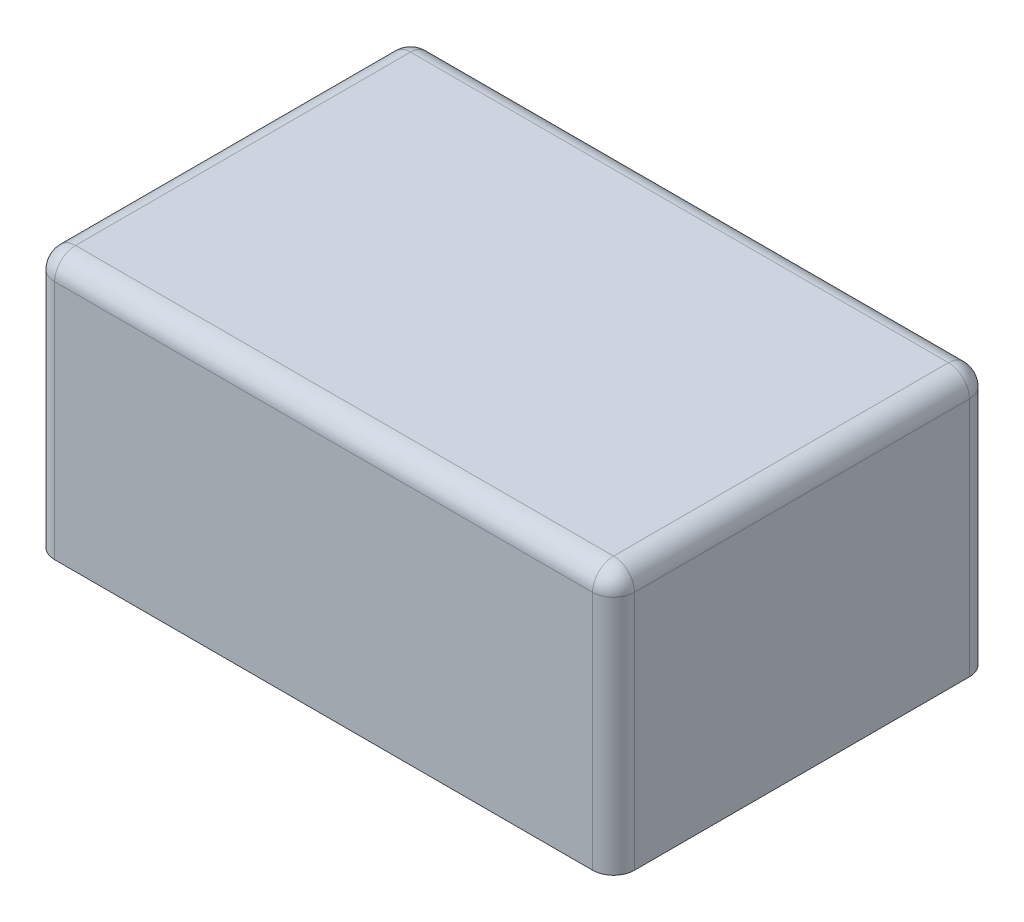
ISO-10303-21;
HEADER;
FILE_DESCRIPTION(('STEP AP214'),'2;1');
FILE_NAME('part.step','',(''),(''),'','','');
FILE_SCHEMA(('AUTOMOTIVE_DESIGN { 1 0 10303 214 1 1 1 1 }'));
ENDSEC;
DATA;
#1=APPLICATION_CONTEXT('core data for automotive mechanical design processes');
#2=APPLICATION_PROTOCOL_DEFINITION('international standard','automotive_design',2000,#1);
#3=PRODUCT_CONTEXT('',#1,'mechanical');
#4=PRODUCT('Part','Part','',(#3));
#5=PRODUCT_RELATED_PRODUCT_CATEGORY('part','',(#4));
#6=PRODUCT_DEFINITION_FORMATION('','',#4);
#7=PRODUCT_DEFINITION_CONTEXT('part definition',#1,'design');
#8=PRODUCT_DEFINITION('design','',#6,#7);
#9=PRODUCT_DEFINITION_SHAPE('','',#8);
#10=(LENGTH_UNIT() NAMED_UNIT(*) SI_UNIT(.MILLI.,.METRE.));
#11=(NAMED_UNIT(*) PLANE_ANGLE_UNIT() SI_UNIT($,.RADIAN.));
#12=(NAMED_UNIT(*) SI_UNIT($,.STERADIAN.) SOLID_ANGLE_UNIT());
#13=UNCERTAINTY_MEASURE_WITH_UNIT(LENGTH_MEASURE(1.E-05),#10,'distance_accuracy_value','');
#14=(GEOMETRIC_REPRESENTATION_CONTEXT(3) GLOBAL_UNCERTAINTY_ASSIGNED_CONTEXT((#13)) GLOBAL_UNIT_ASSIGNED_CONTEXT((#10,
#11,#12)) REPRESENTATION_CONTEXT('',''));
#15=CARTESIAN_POINT('',(0.,0.,0.));
#16=DIRECTION('',(0.,0.,1.));
#17=DIRECTION('',(1.,0.,0.));
#18=AXIS2_PLACEMENT_3D('',#15,#16,#17);
#19=CARTESIAN_POINT('',(27.7,25.,18.));
#20=DIRECTION('',(-1.,0.,0.));
#21=DIRECTION('',(0.,0.,1.));
#22=AXIS2_PLACEMENT_3D('',#19,#20,#21);
#23=PLANE('',#22);
#24=DIRECTION('',(0.,0.,-1.));
#25=VECTOR('',#24,1.);
#26=CARTESIAN_POINT('',(27.7,0.,18.));
#27=LINE('',#26,#25);
#28=CARTESIAN_POINT('',(27.7,0.,16.));
#29=VERTEX_POINT('',#28);
#30=CARTESIAN_POINT('',(27.7,0.,-16.));
#31=VERTEX_POINT('',#30);
#32=EDGE_CURVE('E224',#29,#31,#27,.T.);
#33=ORIENTED_EDGE('',*,*,#32,.T.);
#34=DIRECTION('',(0.,-1.,0.));
#35=VECTOR('',#34,1.);
#36=CARTESIAN_POINT('',(27.7,25.,-16.));
#37=LINE('',#36,#35);
#38=CARTESIAN_POINT('',(27.7,23.,-16.));
#39=VERTEX_POINT('',#38);
#40=EDGE_CURVE('E160',#31,#39,#37,.F.);
#41=ORIENTED_EDGE('',*,*,#40,.T.);
#42=DIRECTION('',(0.,0.,-1.));
#43=VECTOR('',#42,1.);
#44=CARTESIAN_POINT('',(27.7,23.,18.));
#45=LINE('',#44,#43);
#46=CARTESIAN_POINT('',(27.7,23.,16.));
#47=VERTEX_POINT('',#46);
#48=EDGE_CURVE('E157',#39,#47,#45,.F.);
#49=ORIENTED_EDGE('',*,*,#48,.T.);
#50=DIRECTION('',(0.,-1.,0.));
#51=VECTOR('',#50,1.);
#52=CARTESIAN_POINT('',(27.7,25.,16.));
#53=LINE('',#52,#51);
#54=EDGE_CURVE('E155',#47,#29,#53,.T.);
#55=ORIENTED_EDGE('',*,*,#54,.T.);
#56=EDGE_LOOP('',(#33,#41,#49,#55));
#57=FACE_BOUND('',#56,.T.);
#58=ADVANCED_FACE('F35',(#57),#23,.F.);
#59=CARTESIAN_POINT('',(-27.7,25.,-18.));
#60=DIRECTION('',(0.,0.,1.));
#61=DIRECTION('',(1.,0.,0.));
#62=AXIS2_PLACEMENT_3D('',#59,#60,#61);
#63=PLANE('',#62);
#64=DIRECTION('',(-1.,0.,0.));
#65=VECTOR('',#64,1.);
#66=CARTESIAN_POINT('',(-27.7,23.,-18.));
#67=LINE('',#66,#65);
#68=CARTESIAN_POINT('',(-25.7,23.,-18.));
#69=VERTEX_POINT('',#68);
#70=CARTESIAN_POINT('',(25.7,23.,-18.));
#71=VERTEX_POINT('',#70);
#72=EDGE_CURVE('E164',#69,#71,#67,.F.);
#73=ORIENTED_EDGE('',*,*,#72,.T.);
#74=DIRECTION('',(0.,-1.,0.));
#75=VECTOR('',#74,1.);
#76=CARTESIAN_POINT('',(25.7,25.,-18.));
#77=LINE('',#76,#75);
#78=CARTESIAN_POINT('',(25.7,0.,-18.));
#79=VERTEX_POINT('',#78);
#80=EDGE_CURVE('E166',#71,#79,#77,.T.);
#81=ORIENTED_EDGE('',*,*,#80,.T.);
#82=DIRECTION('',(-1.,0.,0.));
#83=VECTOR('',#82,1.);
#84=CARTESIAN_POINT('',(-27.7,0.,-18.));
#85=LINE('',#84,#83);
#86=CARTESIAN_POINT('',(-25.7,0.,-18.));
#87=VERTEX_POINT('',#86);
#88=EDGE_CURVE('E226',#79,#87,#85,.T.);
#89=ORIENTED_EDGE('',*,*,#88,.T.);
#90=DIRECTION('',(0.,-1.,0.));
#91=VECTOR('',#90,1.);
#92=CARTESIAN_POINT('',(-25.7,25.,-18.));
#93=LINE('',#92,#91);
#94=EDGE_CURVE('E162',#87,#69,#93,.F.);
#95=ORIENTED_EDGE('',*,*,#94,.T.);
#96=EDGE_LOOP('',(#73,#81,#89,#95));
#97=FACE_BOUND('',#96,.T.);
#98=ADVANCED_FACE('F210',(#97),#63,.F.);
#99=CARTESIAN_POINT('',(-27.7,25.,18.));
#100=DIRECTION('',(1.,0.,0.));
#101=DIRECTION('',(0.,0.,-1.));
#102=AXIS2_PLACEMENT_3D('',#99,#100,#101);
#103=PLANE('',#102);
#104=DIRECTION('',(0.,0.,1.));
#105=VECTOR('',#104,1.);
#106=CARTESIAN_POINT('',(-27.7,23.,18.));
#107=LINE('',#106,#105);
#108=CARTESIAN_POINT('',(-27.7,23.,16.));
#109=VERTEX_POINT('',#108);
#110=CARTESIAN_POINT('',(-27.7,23.,-16.));
#111=VERTEX_POINT('',#110);
#112=EDGE_CURVE('E129',#109,#111,#107,.F.);
#113=ORIENTED_EDGE('',*,*,#112,.T.);
#114=DIRECTION('',(0.,-1.,0.));
#115=VECTOR('',#114,1.);
#116=CARTESIAN_POINT('',(-27.7,25.,-16.));
#117=LINE('',#116,#115);
#118=CARTESIAN_POINT('',(-27.7,0.,-16.));
#119=VERTEX_POINT('',#118);
#120=EDGE_CURVE('E171',#111,#119,#117,.T.);
#121=ORIENTED_EDGE('',*,*,#120,.T.);
#122=DIRECTION('',(0.,0.,1.));
#123=VECTOR('',#122,1.);
#124=CARTESIAN_POINT('',(-27.7,0.,18.));
#125=LINE('',#124,#123);
#126=CARTESIAN_POINT('',(-27.7,0.,16.));
#127=VERTEX_POINT('',#126);
#128=EDGE_CURVE('E231',#119,#127,#125,.T.);
#129=ORIENTED_EDGE('',*,*,#128,.T.);
#130=DIRECTION('',(0.,-1.,0.));
#131=VECTOR('',#130,1.);
#132=CARTESIAN_POINT('',(-27.7,25.,16.));
#133=LINE('',#132,#131);
#134=EDGE_CURVE('E168',#127,#109,#133,.F.);
#135=ORIENTED_EDGE('',*,*,#134,.T.);
#136=EDGE_LOOP('',(#113,#121,#129,#135));
#137=FACE_BOUND('',#136,.T.);
#138=ADVANCED_FACE('F277',(#137),#103,.F.);
#139=CARTESIAN_POINT('',(-27.7,25.,18.));
#140=DIRECTION('',(0.,0.,-1.));
#141=DIRECTION('',(-1.,0.,0.));
#142=AXIS2_PLACEMENT_3D('',#139,#140,#141);
#143=PLANE('',#142);
#144=DIRECTION('',(1.,0.,0.));
#145=VECTOR('',#144,1.);
#146=CARTESIAN_POINT('',(-27.7,0.,18.));
#147=LINE('',#146,#145);
#148=CARTESIAN_POINT('',(-25.7,0.,18.));
#149=VERTEX_POINT('',#148);
#150=CARTESIAN_POINT('',(25.7,0.,18.));
#151=VERTEX_POINT('',#150);
#152=EDGE_CURVE('E240',#149,#151,#147,.T.);
#153=ORIENTED_EDGE('',*,*,#152,.T.);
#154=DIRECTION('',(0.,-1.,0.));
#155=VECTOR('',#154,1.);
#156=CARTESIAN_POINT('',(25.7,25.,18.));
#157=LINE('',#156,#155);
#158=CARTESIAN_POINT('',(25.7,23.,18.));
#159=VERTEX_POINT('',#158);
#160=EDGE_CURVE('E52',#151,#159,#157,.F.);
#161=ORIENTED_EDGE('',*,*,#160,.T.);
#162=DIRECTION('',(1.,0.,0.));
#163=VECTOR('',#162,1.);
#164=CARTESIAN_POINT('',(-27.7,23.,18.));
#165=LINE('',#164,#163);
#166=CARTESIAN_POINT('',(-25.7,23.,18.));
#167=VERTEX_POINT('',#166);
#168=EDGE_CURVE('E56',#159,#167,#165,.F.);
#169=ORIENTED_EDGE('',*,*,#168,.T.);
#170=DIRECTION('',(0.,-1.,0.));
#171=VECTOR('',#170,1.);
#172=CARTESIAN_POINT('',(-25.7,25.,18.));
#173=LINE('',#172,#171);
#174=EDGE_CURVE('E173',#167,#149,#173,.T.);
#175=ORIENTED_EDGE('',*,*,#174,.T.);
#176=EDGE_LOOP('',(#153,#161,#169,#175));
#177=FACE_BOUND('',#176,.T.);
#178=ADVANCED_FACE('F330',(#177),#143,.F.);
#179=CARTESIAN_POINT('',(0.,25.,0.));
#180=DIRECTION('',(0.,-1.,0.));
#181=DIRECTION('',(0.,0.,-1.));
#182=AXIS2_PLACEMENT_3D('',#179,#180,#181);
#183=PLANE('',#182);
#184=DIRECTION('',(1.,0.,0.));
#185=VECTOR('',#184,1.);
#186=CARTESIAN_POINT('',(0.,25.,16.));
#187=LINE('',#186,#185);
#188=CARTESIAN_POINT('',(-25.7,25.,16.));
#189=VERTEX_POINT('',#188);
#190=CARTESIAN_POINT('',(25.7,25.,16.));
#191=VERTEX_POINT('',#190);
#192=EDGE_CURVE('E116',#189,#191,#187,.T.);
#193=ORIENTED_EDGE('',*,*,#192,.T.);
#194=DIRECTION('',(0.,0.,-1.));
#195=VECTOR('',#194,1.);
#196=CARTESIAN_POINT('',(25.7,25.,0.));
#197=LINE('',#196,#195);
#198=CARTESIAN_POINT('',(25.7,25.,-16.));
#199=VERTEX_POINT('',#198);
#200=EDGE_CURVE('E153',#191,#199,#197,.T.);
#201=ORIENTED_EDGE('',*,*,#200,.T.);
#202=DIRECTION('',(-1.,0.,0.));
#203=VECTOR('',#202,1.);
#204=CARTESIAN_POINT('',(0.,25.,-16.));
#205=LINE('',#204,#203);
#206=CARTESIAN_POINT('',(-25.7,25.,-16.));
#207=VERTEX_POINT('',#206);
#208=EDGE_CURVE('E119',#199,#207,#205,.T.);
#209=ORIENTED_EDGE('',*,*,#208,.T.);
#210=DIRECTION('',(0.,0.,1.));
#211=VECTOR('',#210,1.);
#212=CARTESIAN_POINT('',(-25.7,25.,0.));
#213=LINE('',#212,#211);
#214=EDGE_CURVE('E111',#207,#189,#213,.T.);
#215=ORIENTED_EDGE('',*,*,#214,.T.);
#216=EDGE_LOOP('',(#193,#201,#209,#215));
#217=FACE_BOUND('',#216,.T.);
#218=ADVANCED_FACE('F113',(#217),#183,.F.);
#219=CARTESIAN_POINT('',(0.,0.,0.));
#220=DIRECTION('',(0.,-1.,0.));
#221=DIRECTION('',(0.,0.,-1.));
#222=AXIS2_PLACEMENT_3D('',#219,#220,#221);
#223=PLANE('',#222);
#224=CARTESIAN_POINT('',(-24.,0.,-6.));
#225=DIRECTION('',(0.,-1.,0.));
#226=DIRECTION('',(0.,0.,-1.));
#227=AXIS2_PLACEMENT_3D('',#224,#225,#226);
#228=CIRCLE('',#227,0.499999999999999);
#229=CARTESIAN_POINT('',(-24.,0.,-6.5));
#230=VERTEX_POINT('',#229);
#231=EDGE_CURVE('E145',#230,#230,#228,.T.);
#232=ORIENTED_EDGE('',*,*,#231,.F.);
#233=EDGE_LOOP('',(#232));
#234=FACE_BOUND('',#233,.T.);
#235=CARTESIAN_POINT('',(24.,0.,1.));
#236=DIRECTION('',(0.,-1.,0.));
#237=DIRECTION('',(0.,0.,-1.));
#238=AXIS2_PLACEMENT_3D('',#235,#236,#237);
#239=CIRCLE('',#238,0.499999999999999);
#240=CARTESIAN_POINT('',(24.,0.,0.500000000000001));
#241=VERTEX_POINT('',#240);
#242=EDGE_CURVE('E148',#241,#241,#239,.T.);
#243=ORIENTED_EDGE('',*,*,#242,.F.);
#244=EDGE_LOOP('',(#243));
#245=FACE_BOUND('',#244,.T.);
#246=CARTESIAN_POINT('',(24.,0.,6.));
#247=DIRECTION('',(0.,-1.,0.));
#248=DIRECTION('',(0.,0.,-1.));
#249=AXIS2_PLACEMENT_3D('',#246,#247,#248);
#250=CIRCLE('',#249,0.499999999999999);
#251=CARTESIAN_POINT('',(24.,0.,5.5));
#252=VERTEX_POINT('',#251);
#253=EDGE_CURVE('E245',#252,#252,#250,.T.);
#254=ORIENTED_EDGE('',*,*,#253,.F.);
#255=EDGE_LOOP('',(#254));
#256=FACE_BOUND('',#255,.T.);
#257=CARTESIAN_POINT('',(-24.,0.,6.));
#258=DIRECTION('',(0.,-1.,0.));
#259=DIRECTION('',(0.,0.,-1.));
#260=AXIS2_PLACEMENT_3D('',#257,#258,#259);
#261=CIRCLE('',#260,0.499999999999999);
#262=CARTESIAN_POINT('',(-24.,0.,5.5));
#263=VERTEX_POINT('',#262);
#264=EDGE_CURVE('E242',#263,#263,#261,.T.);
#265=ORIENTED_EDGE('',*,*,#264,.F.);
#266=EDGE_LOOP('',(#265));
#267=FACE_BOUND('',#266,.T.);
#268=ORIENTED_EDGE('',*,*,#88,.F.);
#269=CARTESIAN_POINT('',(25.7,0.,-16.));
#270=DIRECTION('',(0.,-1.,0.));
#271=DIRECTION('',(0.,0.,-1.));
#272=AXIS2_PLACEMENT_3D('',#269,#270,#271);
#273=CIRCLE('',#272,2.);
#274=EDGE_CURVE('E11',#79,#31,#273,.T.);
#275=ORIENTED_EDGE('',*,*,#274,.T.);
#276=ORIENTED_EDGE('',*,*,#32,.F.);
#277=CARTESIAN_POINT('',(25.7,0.,16.));
#278=DIRECTION('',(0.,-1.,0.));
#279=DIRECTION('',(0.,0.,-1.));
#280=AXIS2_PLACEMENT_3D('',#277,#278,#279);
#281=CIRCLE('',#280,2.);
#282=EDGE_CURVE('E44',#29,#151,#281,.T.);
#283=ORIENTED_EDGE('',*,*,#282,.T.);
#284=ORIENTED_EDGE('',*,*,#152,.F.);
#285=CARTESIAN_POINT('',(-25.7,0.,16.));
#286=DIRECTION('',(0.,-1.,0.));
#287=DIRECTION('',(0.,0.,-1.));
#288=AXIS2_PLACEMENT_3D('',#285,#286,#287);
#289=CIRCLE('',#288,2.);
#290=EDGE_CURVE('E177',#149,#127,#289,.T.);
#291=ORIENTED_EDGE('',*,*,#290,.T.);
#292=ORIENTED_EDGE('',*,*,#128,.F.);
#293=CARTESIAN_POINT('',(-25.7,0.,-16.));
#294=DIRECTION('',(0.,-1.,0.));
#295=DIRECTION('',(0.,0.,-1.));
#296=AXIS2_PLACEMENT_3D('',#293,#294,#295);
#297=CIRCLE('',#296,2.);
#298=EDGE_CURVE('E179',#119,#87,#297,.T.);
#299=ORIENTED_EDGE('',*,*,#298,.T.);
#300=EDGE_LOOP('',(#268,#275,#276,#283,#284,#291,#292,#299));
#301=FACE_BOUND('',#300,.T.);
#302=ADVANCED_FACE('F223',(#234,#245,#256,#267,#301),#223,.T.);
#303=CARTESIAN_POINT('',(-24.,-3.,6.));
#304=DIRECTION('',(0.,1.,0.));
#305=DIRECTION('',(0.,0.,1.));
#306=AXIS2_PLACEMENT_3D('',#303,#304,#305);
#307=CYLINDRICAL_SURFACE('',#306,0.499999999999999);
#308=CARTESIAN_POINT('',(-24.,-3.,6.));
#309=DIRECTION('',(0.,1.,0.));
#310=DIRECTION('',(0.,0.,1.));
#311=AXIS2_PLACEMENT_3D('',#308,#309,#310);
#312=CIRCLE('',#311,0.499999999999999);
#313=CARTESIAN_POINT('',(-24.,-3.,6.5));
#314=VERTEX_POINT('',#313);
#315=EDGE_CURVE('E229',#314,#314,#312,.T.);
#316=ORIENTED_EDGE('',*,*,#315,.T.);
#317=EDGE_LOOP('',(#316));
#318=FACE_BOUND('',#317,.T.);
#319=ORIENTED_EDGE('',*,*,#264,.T.);
#320=EDGE_LOOP('',(#319));
#321=FACE_BOUND('',#320,.T.);
#322=ADVANCED_FACE('F254',(#318,#321),#307,.T.);
#323=CARTESIAN_POINT('',(-24.,-3.,6.));
#324=DIRECTION('',(0.,1.,0.));
#325=DIRECTION('',(0.,0.,1.));
#326=AXIS2_PLACEMENT_3D('',#323,#324,#325);
#327=PLANE('',#326);
#328=ORIENTED_EDGE('',*,*,#315,.F.);
#329=EDGE_LOOP('',(#328));
#330=FACE_BOUND('',#329,.T.);
#331=ADVANCED_FACE('F262',(#330),#327,.F.);
#332=CARTESIAN_POINT('',(24.,-3.,6.));
#333=DIRECTION('',(0.,1.,0.));
#334=DIRECTION('',(0.,0.,1.));
#335=AXIS2_PLACEMENT_3D('',#332,#333,#334);
#336=CYLINDRICAL_SURFACE('',#335,0.499999999999999);
#337=CARTESIAN_POINT('',(24.,-3.,6.));
#338=DIRECTION('',(0.,1.,0.));
#339=DIRECTION('',(0.,0.,1.));
#340=AXIS2_PLACEMENT_3D('',#337,#338,#339);
#341=CIRCLE('',#340,0.499999999999999);
#342=CARTESIAN_POINT('',(24.,-3.,6.5));
#343=VERTEX_POINT('',#342);
#344=EDGE_CURVE('E234',#343,#343,#341,.T.);
#345=ORIENTED_EDGE('',*,*,#344,.T.);
#346=EDGE_LOOP('',(#345));
#347=FACE_BOUND('',#346,.T.);
#348=ORIENTED_EDGE('',*,*,#253,.T.);
#349=EDGE_LOOP('',(#348));
#350=FACE_BOUND('',#349,.T.);
#351=ADVANCED_FACE('F268',(#347,#350),#336,.T.);
#352=CARTESIAN_POINT('',(24.,-3.,6.));
#353=DIRECTION('',(0.,1.,0.));
#354=DIRECTION('',(0.,0.,1.));
#355=AXIS2_PLACEMENT_3D('',#352,#353,#354);
#356=PLANE('',#355);
#357=ORIENTED_EDGE('',*,*,#344,.F.);
#358=EDGE_LOOP('',(#357));
#359=FACE_BOUND('',#358,.T.);
#360=ADVANCED_FACE('F448',(#359),#356,.F.);
#361=CARTESIAN_POINT('',(24.,-3.,1.));
#362=DIRECTION('',(0.,1.,0.));
#363=DIRECTION('',(0.,0.,1.));
#364=AXIS2_PLACEMENT_3D('',#361,#362,#363);
#365=CYLINDRICAL_SURFACE('',#364,0.499999999999999);
#366=CARTESIAN_POINT('',(24.,-3.,1.));
#367=DIRECTION('',(0.,1.,0.));
#368=DIRECTION('',(0.,0.,1.));
#369=AXIS2_PLACEMENT_3D('',#366,#367,#368);
#370=CIRCLE('',#369,0.499999999999999);
#371=CARTESIAN_POINT('',(24.,-3.,1.5));
#372=VERTEX_POINT('',#371);
#373=EDGE_CURVE('E498',#372,#372,#370,.T.);
#374=ORIENTED_EDGE('',*,*,#373,.T.);
#375=EDGE_LOOP('',(#374));
#376=FACE_BOUND('',#375,.T.);
#377=ORIENTED_EDGE('',*,*,#242,.T.);
#378=EDGE_LOOP('',(#377));
#379=FACE_BOUND('',#378,.T.);
#380=ADVANCED_FACE('F250',(#376,#379),#365,.T.);
#381=CARTESIAN_POINT('',(24.,-3.,1.));
#382=DIRECTION('',(0.,1.,0.));
#383=DIRECTION('',(0.,0.,1.));
#384=AXIS2_PLACEMENT_3D('',#381,#382,#383);
#385=PLANE('',#384);
#386=ORIENTED_EDGE('',*,*,#373,.F.);
#387=EDGE_LOOP('',(#386));
#388=FACE_BOUND('',#387,.T.);
#389=ADVANCED_FACE('F429',(#388),#385,.F.);
#390=CARTESIAN_POINT('',(-24.,-3.,-6.));
#391=DIRECTION('',(0.,1.,0.));
#392=DIRECTION('',(0.,0.,1.));
#393=AXIS2_PLACEMENT_3D('',#390,#391,#392);
#394=CYLINDRICAL_SURFACE('',#393,0.499999999999999);
#395=CARTESIAN_POINT('',(-24.,-3.,-6.));
#396=DIRECTION('',(0.,1.,0.));
#397=DIRECTION('',(0.,0.,1.));
#398=AXIS2_PLACEMENT_3D('',#395,#396,#397);
#399=CIRCLE('',#398,0.499999999999999);
#400=CARTESIAN_POINT('',(-24.,-3.,-5.5));
#401=VERTEX_POINT('',#400);
#402=EDGE_CURVE('E500',#401,#401,#399,.T.);
#403=ORIENTED_EDGE('',*,*,#402,.T.);
#404=EDGE_LOOP('',(#403));
#405=FACE_BOUND('',#404,.T.);
#406=ORIENTED_EDGE('',*,*,#231,.T.);
#407=EDGE_LOOP('',(#406));
#408=FACE_BOUND('',#407,.T.);
#409=ADVANCED_FACE('F319',(#405,#408),#394,.T.);
#410=CARTESIAN_POINT('',(-24.,-3.,-6.));
#411=DIRECTION('',(0.,1.,0.));
#412=DIRECTION('',(0.,0.,1.));
#413=AXIS2_PLACEMENT_3D('',#410,#411,#412);
#414=PLANE('',#413);
#415=ORIENTED_EDGE('',*,*,#402,.F.);
#416=EDGE_LOOP('',(#415));
#417=FACE_BOUND('',#416,.T.);
#418=ADVANCED_FACE('F314',(#417),#414,.F.);
#419=CARTESIAN_POINT('',(-25.7,25.,16.));
#420=DIRECTION('',(0.,-1.,0.));
#421=DIRECTION('',(0.,0.,-1.));
#422=AXIS2_PLACEMENT_3D('',#419,#420,#421);
#423=CYLINDRICAL_SURFACE('',#422,2.);
#424=ORIENTED_EDGE('',*,*,#290,.F.);
#425=ORIENTED_EDGE('',*,*,#174,.F.);
#426=CARTESIAN_POINT('',(-25.7,23.,16.));
#427=DIRECTION('',(0.,1.,0.));
#428=DIRECTION('',(0.,0.,1.));
#429=AXIS2_PLACEMENT_3D('',#426,#427,#428);
#430=CIRCLE('',#429,2.);
#431=EDGE_CURVE('E39',#109,#167,#430,.T.);
#432=ORIENTED_EDGE('',*,*,#431,.F.);
#433=ORIENTED_EDGE('',*,*,#134,.F.);
#434=EDGE_LOOP('',(#424,#425,#432,#433));
#435=FACE_BOUND('',#434,.T.);
#436=ADVANCED_FACE('F37',(#435),#423,.T.);
#437=CARTESIAN_POINT('',(-25.7,23.,0.));
#438=DIRECTION('',(0.,0.,1.));
#439=DIRECTION('',(1.,0.,0.));
#440=AXIS2_PLACEMENT_3D('',#437,#438,#439);
#441=CYLINDRICAL_SURFACE('',#440,2.);
#442=CARTESIAN_POINT('',(-25.7,23.,-16.));
#443=DIRECTION('',(0.,0.,-1.));
#444=DIRECTION('',(-1.,0.,0.));
#445=AXIS2_PLACEMENT_3D('',#442,#443,#444);
#446=CIRCLE('',#445,2.);
#447=EDGE_CURVE('E133',#111,#207,#446,.T.);
#448=ORIENTED_EDGE('',*,*,#447,.F.);
#449=ORIENTED_EDGE('',*,*,#112,.F.);
#450=CARTESIAN_POINT('',(-25.7,23.,16.));
#451=DIRECTION('',(0.,0.,1.));
#452=DIRECTION('',(1.,0.,0.));
#453=AXIS2_PLACEMENT_3D('',#450,#451,#452);
#454=CIRCLE('',#453,2.);
#455=EDGE_CURVE('E126',#189,#109,#454,.T.);
#456=ORIENTED_EDGE('',*,*,#455,.F.);
#457=ORIENTED_EDGE('',*,*,#214,.F.);
#458=EDGE_LOOP('',(#448,#449,#456,#457));
#459=FACE_BOUND('',#458,.T.);
#460=ADVANCED_FACE('F128',(#459),#441,.T.);
#461=CARTESIAN_POINT('',(-25.7,25.,-16.));
#462=DIRECTION('',(0.,-1.,0.));
#463=DIRECTION('',(0.,0.,-1.));
#464=AXIS2_PLACEMENT_3D('',#461,#462,#463);
#465=CYLINDRICAL_SURFACE('',#464,2.);
#466=ORIENTED_EDGE('',*,*,#298,.F.);
#467=ORIENTED_EDGE('',*,*,#120,.F.);
#468=CARTESIAN_POINT('',(-25.7,23.,-16.));
#469=DIRECTION('',(0.,1.,0.));
#470=DIRECTION('',(0.,0.,1.));
#471=AXIS2_PLACEMENT_3D('',#468,#469,#470);
#472=CIRCLE('',#471,2.);
#473=EDGE_CURVE('E138',#69,#111,#472,.T.);
#474=ORIENTED_EDGE('',*,*,#473,.F.);
#475=ORIENTED_EDGE('',*,*,#94,.F.);
#476=EDGE_LOOP('',(#466,#467,#474,#475));
#477=FACE_BOUND('',#476,.T.);
#478=ADVANCED_FACE('F307',(#477),#465,.T.);
#479=CARTESIAN_POINT('',(-25.7,23.,16.));
#480=DIRECTION('',(0.,0.,1.));
#481=DIRECTION('',(1.,0.,0.));
#482=AXIS2_PLACEMENT_3D('',#479,#480,#481);
#483=SPHERICAL_SURFACE('',#482,2.);
#484=ORIENTED_EDGE('',*,*,#455,.T.);
#485=ORIENTED_EDGE('',*,*,#431,.T.);
#486=CARTESIAN_POINT('',(-25.7,23.,16.));
#487=DIRECTION('',(-1.,0.,0.));
#488=DIRECTION('',(0.,0.,1.));
#489=AXIS2_PLACEMENT_3D('',#486,#487,#488);
#490=CIRCLE('',#489,2.);
#491=EDGE_CURVE('E135',#189,#167,#490,.F.);
#492=ORIENTED_EDGE('',*,*,#491,.F.);
#493=EDGE_LOOP('',(#484,#485,#492));
#494=FACE_BOUND('',#493,.T.);
#495=ADVANCED_FACE('F136',(#494),#483,.T.);
#496=CARTESIAN_POINT('',(-25.7,23.,-16.));
#497=DIRECTION('',(0.,0.,1.));
#498=DIRECTION('',(1.,0.,0.));
#499=AXIS2_PLACEMENT_3D('',#496,#497,#498);
#500=SPHERICAL_SURFACE('',#499,2.);
#501=ORIENTED_EDGE('',*,*,#473,.T.);
#502=ORIENTED_EDGE('',*,*,#447,.T.);
#503=CARTESIAN_POINT('',(-25.7,23.,-16.));
#504=DIRECTION('',(-1.,0.,0.));
#505=DIRECTION('',(0.,0.,1.));
#506=AXIS2_PLACEMENT_3D('',#503,#504,#505);
#507=CIRCLE('',#506,2.);
#508=EDGE_CURVE('E139',#69,#207,#507,.F.);
#509=ORIENTED_EDGE('',*,*,#508,.F.);
#510=EDGE_LOOP('',(#501,#502,#509));
#511=FACE_BOUND('',#510,.T.);
#512=ADVANCED_FACE('F202',(#511),#500,.T.);
#513=CARTESIAN_POINT('',(25.7,25.,16.));
#514=DIRECTION('',(0.,-1.,0.));
#515=DIRECTION('',(0.,0.,-1.));
#516=AXIS2_PLACEMENT_3D('',#513,#514,#515);
#517=CYLINDRICAL_SURFACE('',#516,2.);
#518=ORIENTED_EDGE('',*,*,#282,.F.);
#519=ORIENTED_EDGE('',*,*,#54,.F.);
#520=CARTESIAN_POINT('',(25.7,23.,16.));
#521=DIRECTION('',(0.,1.,0.));
#522=DIRECTION('',(0.,0.,1.));
#523=AXIS2_PLACEMENT_3D('',#520,#521,#522);
#524=CIRCLE('',#523,2.);
#525=EDGE_CURVE('E193',#159,#47,#524,.T.);
#526=ORIENTED_EDGE('',*,*,#525,.F.);
#527=ORIENTED_EDGE('',*,*,#160,.F.);
#528=EDGE_LOOP('',(#518,#519,#526,#527));
#529=FACE_BOUND('',#528,.T.);
#530=ADVANCED_FACE('F299',(#529),#517,.T.);
#531=CARTESIAN_POINT('',(0.,23.,16.));
#532=DIRECTION('',(1.,0.,0.));
#533=DIRECTION('',(0.,0.,-1.));
#534=AXIS2_PLACEMENT_3D('',#531,#532,#533);
#535=CYLINDRICAL_SURFACE('',#534,2.);
#536=ORIENTED_EDGE('',*,*,#491,.T.);
#537=ORIENTED_EDGE('',*,*,#168,.F.);
#538=CARTESIAN_POINT('',(25.7,23.,16.));
#539=DIRECTION('',(1.,0.,0.));
#540=DIRECTION('',(0.,0.,-1.));
#541=AXIS2_PLACEMENT_3D('',#538,#539,#540);
#542=CIRCLE('',#541,2.);
#543=EDGE_CURVE('E143',#191,#159,#542,.T.);
#544=ORIENTED_EDGE('',*,*,#543,.F.);
#545=ORIENTED_EDGE('',*,*,#192,.F.);
#546=EDGE_LOOP('',(#536,#537,#544,#545));
#547=FACE_BOUND('',#546,.T.);
#548=ADVANCED_FACE('F141',(#547),#535,.T.);
#549=CARTESIAN_POINT('',(0.,23.,-16.));
#550=DIRECTION('',(-1.,0.,0.));
#551=DIRECTION('',(0.,0.,1.));
#552=AXIS2_PLACEMENT_3D('',#549,#550,#551);
#553=CYLINDRICAL_SURFACE('',#552,2.);
#554=ORIENTED_EDGE('',*,*,#508,.T.);
#555=ORIENTED_EDGE('',*,*,#208,.F.);
#556=CARTESIAN_POINT('',(25.7,23.,-16.));
#557=DIRECTION('',(1.,0.,0.));
#558=DIRECTION('',(0.,0.,-1.));
#559=AXIS2_PLACEMENT_3D('',#556,#557,#558);
#560=CIRCLE('',#559,2.);
#561=EDGE_CURVE('E189',#71,#199,#560,.T.);
#562=ORIENTED_EDGE('',*,*,#561,.F.);
#563=ORIENTED_EDGE('',*,*,#72,.F.);
#564=EDGE_LOOP('',(#554,#555,#562,#563));
#565=FACE_BOUND('',#564,.T.);
#566=ADVANCED_FACE('F206',(#565),#553,.T.);
#567=CARTESIAN_POINT('',(25.7,25.,-16.));
#568=DIRECTION('',(0.,-1.,0.));
#569=DIRECTION('',(0.,0.,-1.));
#570=AXIS2_PLACEMENT_3D('',#567,#568,#569);
#571=CYLINDRICAL_SURFACE('',#570,2.);
#572=ORIENTED_EDGE('',*,*,#274,.F.);
#573=ORIENTED_EDGE('',*,*,#80,.F.);
#574=CARTESIAN_POINT('',(25.7,23.,-16.));
#575=DIRECTION('',(0.,1.,0.));
#576=DIRECTION('',(0.,0.,1.));
#577=AXIS2_PLACEMENT_3D('',#574,#575,#576);
#578=CIRCLE('',#577,2.);
#579=EDGE_CURVE('E186',#39,#71,#578,.T.);
#580=ORIENTED_EDGE('',*,*,#579,.F.);
#581=ORIENTED_EDGE('',*,*,#40,.F.);
#582=EDGE_LOOP('',(#572,#573,#580,#581));
#583=FACE_BOUND('',#582,.T.);
#584=ADVANCED_FACE('F217',(#583),#571,.T.);
#585=CARTESIAN_POINT('',(25.7,23.,16.));
#586=DIRECTION('',(0.,0.,1.));
#587=DIRECTION('',(1.,0.,0.));
#588=AXIS2_PLACEMENT_3D('',#585,#586,#587);
#589=SPHERICAL_SURFACE('',#588,2.);
#590=ORIENTED_EDGE('',*,*,#543,.T.);
#591=ORIENTED_EDGE('',*,*,#525,.T.);
#592=CARTESIAN_POINT('',(25.7,23.,16.));
#593=DIRECTION('',(0.,0.,1.));
#594=DIRECTION('',(1.,0.,0.));
#595=AXIS2_PLACEMENT_3D('',#592,#593,#594);
#596=CIRCLE('',#595,2.);
#597=EDGE_CURVE('E184',#191,#47,#596,.F.);
#598=ORIENTED_EDGE('',*,*,#597,.F.);
#599=EDGE_LOOP('',(#590,#591,#598));
#600=FACE_BOUND('',#599,.T.);
#601=ADVANCED_FACE('F288',(#600),#589,.T.);
#602=CARTESIAN_POINT('',(25.7,23.,-16.));
#603=DIRECTION('',(0.,0.,1.));
#604=DIRECTION('',(1.,0.,0.));
#605=AXIS2_PLACEMENT_3D('',#602,#603,#604);
#606=SPHERICAL_SURFACE('',#605,2.);
#607=ORIENTED_EDGE('',*,*,#579,.T.);
#608=ORIENTED_EDGE('',*,*,#561,.T.);
#609=CARTESIAN_POINT('',(25.7,23.,-16.));
#610=DIRECTION('',(0.,0.,-1.));
#611=DIRECTION('',(-1.,0.,0.));
#612=AXIS2_PLACEMENT_3D('',#609,#610,#611);
#613=CIRCLE('',#612,2.);
#614=EDGE_CURVE('E182',#39,#199,#613,.F.);
#615=ORIENTED_EDGE('',*,*,#614,.F.);
#616=EDGE_LOOP('',(#607,#608,#615));
#617=FACE_BOUND('',#616,.T.);
#618=ADVANCED_FACE('F284',(#617),#606,.T.);
#619=CARTESIAN_POINT('',(25.7,23.,0.));
#620=DIRECTION('',(0.,0.,-1.));
#621=DIRECTION('',(-1.,0.,0.));
#622=AXIS2_PLACEMENT_3D('',#619,#620,#621);
#623=CYLINDRICAL_SURFACE('',#622,2.);
#624=ORIENTED_EDGE('',*,*,#597,.T.);
#625=ORIENTED_EDGE('',*,*,#48,.F.);
#626=ORIENTED_EDGE('',*,*,#614,.T.);
#627=ORIENTED_EDGE('',*,*,#200,.F.);
#628=EDGE_LOOP('',(#624,#625,#626,#627));
#629=FACE_BOUND('',#628,.T.);
#630=ADVANCED_FACE('F281',(#629),#623,.T.);
#631=CLOSED_SHELL('',(#58,#98,#138,#178,#218,#302,#322,#331,#351,#360,#380,#389,#409,#418,#436,
#460,#478,#495,#512,#530,#548,#566,#584,#601,#618,#630));
#632=MANIFOLD_SOLID_BREP('B2',#631);
#633=ADVANCED_BREP_SHAPE_REPRESENTATION('',(#18,#632),#14);
#634=SHAPE_DEFINITION_REPRESENTATION(#9,#633);
ENDSEC;
END-ISO-10303-21;
